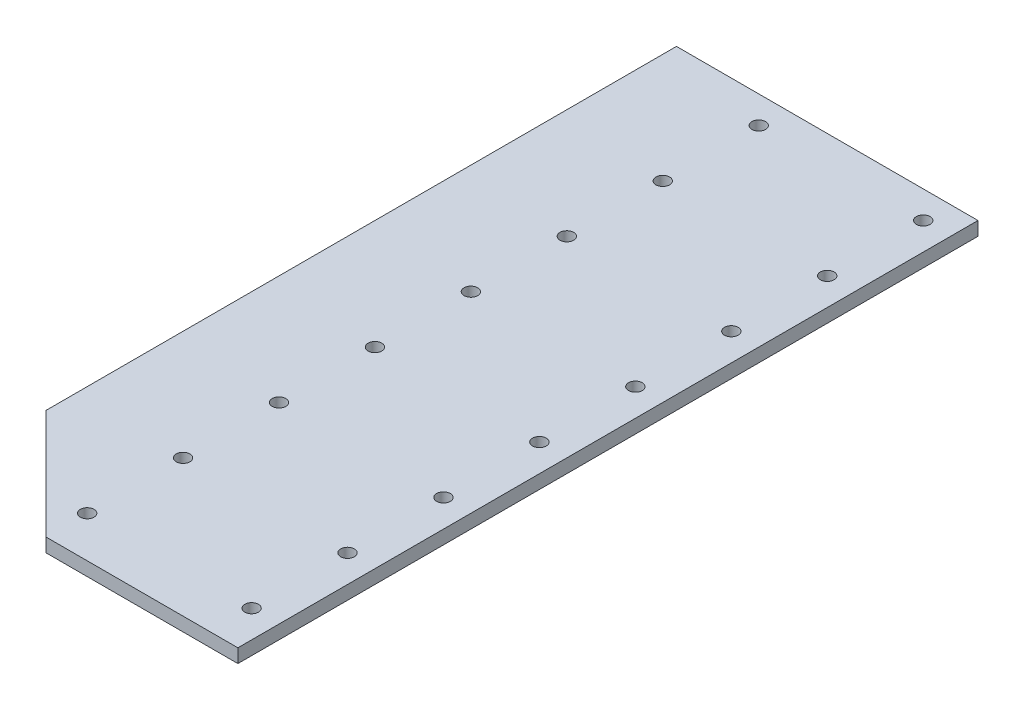
ISO-10303-21;
HEADER;
FILE_DESCRIPTION(('STEP AP214'),'2;1');
FILE_NAME('part.step','',(''),(''),'','','');
FILE_SCHEMA(('AUTOMOTIVE_DESIGN { 1 0 10303 214 1 1 1 1 }'));
ENDSEC;
DATA;
#1=APPLICATION_CONTEXT('core data for automotive mechanical design processes');
#2=APPLICATION_PROTOCOL_DEFINITION('international standard','automotive_design',2000,#1);
#3=PRODUCT_CONTEXT('',#1,'mechanical');
#4=PRODUCT('Part','Part','',(#3));
#5=PRODUCT_RELATED_PRODUCT_CATEGORY('part','',(#4));
#6=PRODUCT_DEFINITION_FORMATION('','',#4);
#7=PRODUCT_DEFINITION_CONTEXT('part definition',#1,'design');
#8=PRODUCT_DEFINITION('design','',#6,#7);
#9=PRODUCT_DEFINITION_SHAPE('','',#8);
#10=(LENGTH_UNIT() NAMED_UNIT(*) SI_UNIT(.MILLI.,.METRE.));
#11=(NAMED_UNIT(*) PLANE_ANGLE_UNIT() SI_UNIT($,.RADIAN.));
#12=(NAMED_UNIT(*) SI_UNIT($,.STERADIAN.) SOLID_ANGLE_UNIT());
#13=UNCERTAINTY_MEASURE_WITH_UNIT(LENGTH_MEASURE(1.E-05),#10,'distance_accuracy_value','');
#14=(GEOMETRIC_REPRESENTATION_CONTEXT(3) GLOBAL_UNCERTAINTY_ASSIGNED_CONTEXT((#13)) GLOBAL_UNIT_ASSIGNED_CONTEXT((#10,
#11,#12)) REPRESENTATION_CONTEXT('',''));
#15=CARTESIAN_POINT('',(0.,0.,0.));
#16=DIRECTION('',(0.,0.,1.));
#17=DIRECTION('',(1.,0.,0.));
#18=AXIS2_PLACEMENT_3D('',#15,#16,#17);
#19=CARTESIAN_POINT('',(0.,5.,0.));
#20=DIRECTION('',(0.,1.,0.));
#21=DIRECTION('',(0.,0.,1.));
#22=AXIS2_PLACEMENT_3D('',#19,#20,#21);
#23=PLANE('',#22);
#24=CARTESIAN_POINT('',(40.,5.,24.9999999999998));
#25=DIRECTION('',(0.,1.,0.));
#26=DIRECTION('',(0.,0.,1.));
#27=AXIS2_PLACEMENT_3D('',#24,#25,#26);
#28=CIRCLE('',#27,2.5);
#29=CARTESIAN_POINT('',(40.,5.,27.4999999999998));
#30=VERTEX_POINT('',#29);
#31=EDGE_CURVE('E248',#30,#30,#28,.T.);
#32=ORIENTED_EDGE('',*,*,#31,.F.);
#33=EDGE_LOOP('',(#32));
#34=FACE_BOUND('',#33,.T.);
#35=CARTESIAN_POINT('',(40.,5.,-10.0000000000001));
#36=DIRECTION('',(0.,1.,0.));
#37=DIRECTION('',(0.,0.,1.));
#38=AXIS2_PLACEMENT_3D('',#35,#36,#37);
#39=CIRCLE('',#38,2.5);
#40=CARTESIAN_POINT('',(40.,5.,-7.50000000000015));
#41=VERTEX_POINT('',#40);
#42=EDGE_CURVE('E264',#41,#41,#39,.T.);
#43=ORIENTED_EDGE('',*,*,#42,.F.);
#44=EDGE_LOOP('',(#43));
#45=FACE_BOUND('',#44,.T.);
#46=CARTESIAN_POINT('',(40.,5.,-45.0000000000001));
#47=DIRECTION('',(0.,1.,0.));
#48=DIRECTION('',(0.,0.,1.));
#49=AXIS2_PLACEMENT_3D('',#46,#47,#48);
#50=CIRCLE('',#49,2.5);
#51=CARTESIAN_POINT('',(40.,5.,-42.5000000000001));
#52=VERTEX_POINT('',#51);
#53=EDGE_CURVE('E280',#52,#52,#50,.T.);
#54=ORIENTED_EDGE('',*,*,#53,.F.);
#55=EDGE_LOOP('',(#54));
#56=FACE_BOUND('',#55,.T.);
#57=CARTESIAN_POINT('',(40.,5.,-80.0000000000001));
#58=DIRECTION('',(0.,1.,0.));
#59=DIRECTION('',(0.,0.,1.));
#60=AXIS2_PLACEMENT_3D('',#57,#58,#59);
#61=CIRCLE('',#60,2.5);
#62=CARTESIAN_POINT('',(40.,5.,-77.5000000000001));
#63=VERTEX_POINT('',#62);
#64=EDGE_CURVE('E296',#63,#63,#61,.T.);
#65=ORIENTED_EDGE('',*,*,#64,.F.);
#66=EDGE_LOOP('',(#65));
#67=FACE_BOUND('',#66,.T.);
#68=CARTESIAN_POINT('',(40.,5.,-115.));
#69=DIRECTION('',(0.,1.,0.));
#70=DIRECTION('',(0.,0.,1.));
#71=AXIS2_PLACEMENT_3D('',#68,#69,#70);
#72=CIRCLE('',#71,2.5);
#73=CARTESIAN_POINT('',(40.,5.,-112.5));
#74=VERTEX_POINT('',#73);
#75=EDGE_CURVE('E312',#74,#74,#72,.T.);
#76=ORIENTED_EDGE('',*,*,#75,.F.);
#77=EDGE_LOOP('',(#76));
#78=FACE_BOUND('',#77,.T.);
#79=CARTESIAN_POINT('',(40.,5.,-150.));
#80=DIRECTION('',(0.,1.,0.));
#81=DIRECTION('',(0.,0.,1.));
#82=AXIS2_PLACEMENT_3D('',#79,#80,#81);
#83=CIRCLE('',#82,2.5);
#84=CARTESIAN_POINT('',(40.,5.,-147.5));
#85=VERTEX_POINT('',#84);
#86=EDGE_CURVE('E328',#85,#85,#83,.T.);
#87=ORIENTED_EDGE('',*,*,#86,.F.);
#88=EDGE_LOOP('',(#87));
#89=FACE_BOUND('',#88,.T.);
#90=CARTESIAN_POINT('',(40.,5.,-185.));
#91=DIRECTION('',(0.,1.,0.));
#92=DIRECTION('',(0.,0.,1.));
#93=AXIS2_PLACEMENT_3D('',#90,#91,#92);
#94=CIRCLE('',#93,2.5);
#95=CARTESIAN_POINT('',(40.,5.,-182.5));
#96=VERTEX_POINT('',#95);
#97=EDGE_CURVE('E344',#96,#96,#94,.T.);
#98=ORIENTED_EDGE('',*,*,#97,.F.);
#99=EDGE_LOOP('',(#98));
#100=FACE_BOUND('',#99,.T.);
#101=CARTESIAN_POINT('',(40.,5.,-220.));
#102=DIRECTION('',(0.,1.,0.));
#103=DIRECTION('',(0.,0.,1.));
#104=AXIS2_PLACEMENT_3D('',#101,#102,#103);
#105=CIRCLE('',#104,2.5);
#106=CARTESIAN_POINT('',(40.,5.,-217.5));
#107=VERTEX_POINT('',#106);
#108=EDGE_CURVE('E129',#107,#107,#105,.T.);
#109=ORIENTED_EDGE('',*,*,#108,.F.);
#110=EDGE_LOOP('',(#109));
#111=FACE_BOUND('',#110,.T.);
#112=DIRECTION('',(0.707106781186556,0.,0.707106781186539));
#113=VECTOR('',#112,1.);
#114=CARTESIAN_POINT('',(0.,5.,0.));
#115=LINE('',#114,#113);
#116=CARTESIAN_POINT('',(0.,5.,0.));
#117=VERTEX_POINT('',#116);
#118=CARTESIAN_POINT('',(40.,5.,39.999999999999));
#119=VERTEX_POINT('',#118);
#120=EDGE_CURVE('E139',#117,#119,#115,.T.);
#121=ORIENTED_EDGE('',*,*,#120,.T.);
#122=DIRECTION('',(1.,0.,0.));
#123=VECTOR('',#122,1.);
#124=CARTESIAN_POINT('',(40.,5.,39.999999999999));
#125=LINE('',#124,#123);
#126=CARTESIAN_POINT('',(110.,5.,39.999999999999));
#127=VERTEX_POINT('',#126);
#128=EDGE_CURVE('E97',#119,#127,#125,.T.);
#129=ORIENTED_EDGE('',*,*,#128,.T.);
#130=DIRECTION('',(0.,0.,-1.));
#131=VECTOR('',#130,1.);
#132=CARTESIAN_POINT('',(110.,5.,39.999999999999));
#133=LINE('',#132,#131);
#134=CARTESIAN_POINT('',(110.,5.,-230.));
#135=VERTEX_POINT('',#134);
#136=EDGE_CURVE('E101',#127,#135,#133,.T.);
#137=ORIENTED_EDGE('',*,*,#136,.T.);
#138=DIRECTION('',(-1.,0.,0.));
#139=VECTOR('',#138,1.);
#140=CARTESIAN_POINT('',(0.,5.,-230.));
#141=LINE('',#140,#139);
#142=CARTESIAN_POINT('',(0.,5.,-230.));
#143=VERTEX_POINT('',#142);
#144=EDGE_CURVE('E105',#135,#143,#141,.T.);
#145=ORIENTED_EDGE('',*,*,#144,.T.);
#146=DIRECTION('',(0.,0.,1.));
#147=VECTOR('',#146,1.);
#148=CARTESIAN_POINT('',(0.,5.,0.));
#149=LINE('',#148,#147);
#150=EDGE_CURVE('E63',#143,#117,#149,.T.);
#151=ORIENTED_EDGE('',*,*,#150,.T.);
#152=EDGE_LOOP('',(#121,#129,#137,#145,#151));
#153=FACE_BOUND('',#152,.T.);
#154=CARTESIAN_POINT('',(100.,5.,-220.));
#155=DIRECTION('',(0.,1.,0.));
#156=DIRECTION('',(0.,0.,1.));
#157=AXIS2_PLACEMENT_3D('',#154,#155,#156);
#158=CIRCLE('',#157,2.5);
#159=CARTESIAN_POINT('',(100.,5.,-217.5));
#160=VERTEX_POINT('',#159);
#161=EDGE_CURVE('E352',#160,#160,#158,.T.);
#162=ORIENTED_EDGE('',*,*,#161,.F.);
#163=EDGE_LOOP('',(#162));
#164=FACE_BOUND('',#163,.T.);
#165=CARTESIAN_POINT('',(100.,5.,-185.));
#166=DIRECTION('',(0.,1.,0.));
#167=DIRECTION('',(0.,0.,1.));
#168=AXIS2_PLACEMENT_3D('',#165,#166,#167);
#169=CIRCLE('',#168,2.5);
#170=CARTESIAN_POINT('',(100.,5.,-182.5));
#171=VERTEX_POINT('',#170);
#172=EDGE_CURVE('E336',#171,#171,#169,.T.);
#173=ORIENTED_EDGE('',*,*,#172,.F.);
#174=EDGE_LOOP('',(#173));
#175=FACE_BOUND('',#174,.T.);
#176=CARTESIAN_POINT('',(100.,5.,-150.));
#177=DIRECTION('',(0.,1.,0.));
#178=DIRECTION('',(0.,0.,1.));
#179=AXIS2_PLACEMENT_3D('',#176,#177,#178);
#180=CIRCLE('',#179,2.5);
#181=CARTESIAN_POINT('',(100.,5.,-147.5));
#182=VERTEX_POINT('',#181);
#183=EDGE_CURVE('E320',#182,#182,#180,.T.);
#184=ORIENTED_EDGE('',*,*,#183,.F.);
#185=EDGE_LOOP('',(#184));
#186=FACE_BOUND('',#185,.T.);
#187=CARTESIAN_POINT('',(100.,5.,-115.));
#188=DIRECTION('',(0.,1.,0.));
#189=DIRECTION('',(0.,0.,1.));
#190=AXIS2_PLACEMENT_3D('',#187,#188,#189);
#191=CIRCLE('',#190,2.5);
#192=CARTESIAN_POINT('',(100.,5.,-112.5));
#193=VERTEX_POINT('',#192);
#194=EDGE_CURVE('E304',#193,#193,#191,.T.);
#195=ORIENTED_EDGE('',*,*,#194,.F.);
#196=EDGE_LOOP('',(#195));
#197=FACE_BOUND('',#196,.T.);
#198=CARTESIAN_POINT('',(100.,5.,-80.0000000000001));
#199=DIRECTION('',(0.,1.,0.));
#200=DIRECTION('',(0.,0.,1.));
#201=AXIS2_PLACEMENT_3D('',#198,#199,#200);
#202=CIRCLE('',#201,2.5);
#203=CARTESIAN_POINT('',(100.,5.,-77.5000000000001));
#204=VERTEX_POINT('',#203);
#205=EDGE_CURVE('E288',#204,#204,#202,.T.);
#206=ORIENTED_EDGE('',*,*,#205,.F.);
#207=EDGE_LOOP('',(#206));
#208=FACE_BOUND('',#207,.T.);
#209=CARTESIAN_POINT('',(100.,5.,-45.0000000000001));
#210=DIRECTION('',(0.,1.,0.));
#211=DIRECTION('',(0.,0.,1.));
#212=AXIS2_PLACEMENT_3D('',#209,#210,#211);
#213=CIRCLE('',#212,2.5);
#214=CARTESIAN_POINT('',(100.,5.,-42.5000000000001));
#215=VERTEX_POINT('',#214);
#216=EDGE_CURVE('E272',#215,#215,#213,.T.);
#217=ORIENTED_EDGE('',*,*,#216,.F.);
#218=EDGE_LOOP('',(#217));
#219=FACE_BOUND('',#218,.T.);
#220=CARTESIAN_POINT('',(100.,5.,-10.0000000000001));
#221=DIRECTION('',(0.,1.,0.));
#222=DIRECTION('',(0.,0.,1.));
#223=AXIS2_PLACEMENT_3D('',#220,#221,#222);
#224=CIRCLE('',#223,2.5);
#225=CARTESIAN_POINT('',(100.,5.,-7.50000000000015));
#226=VERTEX_POINT('',#225);
#227=EDGE_CURVE('E256',#226,#226,#224,.T.);
#228=ORIENTED_EDGE('',*,*,#227,.F.);
#229=EDGE_LOOP('',(#228));
#230=FACE_BOUND('',#229,.T.);
#231=CARTESIAN_POINT('',(100.,5.,24.9999999999998));
#232=DIRECTION('',(0.,1.,0.));
#233=DIRECTION('',(0.,0.,1.));
#234=AXIS2_PLACEMENT_3D('',#231,#232,#233);
#235=CIRCLE('',#234,2.49999999999999);
#236=CARTESIAN_POINT('',(100.,5.,27.4999999999998));
#237=VERTEX_POINT('',#236);
#238=EDGE_CURVE('E237',#237,#237,#235,.T.);
#239=ORIENTED_EDGE('',*,*,#238,.F.);
#240=EDGE_LOOP('',(#239));
#241=FACE_BOUND('',#240,.T.);
#242=ADVANCED_FACE('F45',(#34,#45,#56,#67,#78,#89,#100,#111,#153,#164,#175,#186,#197,#208,#219,
#230,#241),#23,.T.);
#243=CARTESIAN_POINT('',(0.,0.,0.));
#244=DIRECTION('',(0.,1.,0.));
#245=DIRECTION('',(0.,0.,1.));
#246=AXIS2_PLACEMENT_3D('',#243,#244,#245);
#247=PLANE('',#246);
#248=DIRECTION('',(0.707106781186556,0.,0.707106781186539));
#249=VECTOR('',#248,1.);
#250=CARTESIAN_POINT('',(0.,0.,0.));
#251=LINE('',#250,#249);
#252=CARTESIAN_POINT('',(0.,0.,0.));
#253=VERTEX_POINT('',#252);
#254=CARTESIAN_POINT('',(40.,0.,39.999999999999));
#255=VERTEX_POINT('',#254);
#256=EDGE_CURVE('E124',#253,#255,#251,.T.);
#257=ORIENTED_EDGE('',*,*,#256,.F.);
#258=DIRECTION('',(0.,0.,1.));
#259=VECTOR('',#258,1.);
#260=CARTESIAN_POINT('',(0.,0.,0.));
#261=LINE('',#260,#259);
#262=CARTESIAN_POINT('',(0.,0.,-230.));
#263=VERTEX_POINT('',#262);
#264=EDGE_CURVE('E89',#263,#253,#261,.T.);
#265=ORIENTED_EDGE('',*,*,#264,.F.);
#266=DIRECTION('',(-1.,0.,0.));
#267=VECTOR('',#266,1.);
#268=CARTESIAN_POINT('',(0.,0.,-230.));
#269=LINE('',#268,#267);
#270=CARTESIAN_POINT('',(110.,0.,-230.));
#271=VERTEX_POINT('',#270);
#272=EDGE_CURVE('E83',#271,#263,#269,.T.);
#273=ORIENTED_EDGE('',*,*,#272,.F.);
#274=DIRECTION('',(0.,0.,-1.));
#275=VECTOR('',#274,1.);
#276=CARTESIAN_POINT('',(110.,0.,35.));
#277=LINE('',#276,#275);
#278=CARTESIAN_POINT('',(110.,0.,39.999999999999));
#279=VERTEX_POINT('',#278);
#280=EDGE_CURVE('E112',#279,#271,#277,.T.);
#281=ORIENTED_EDGE('',*,*,#280,.F.);
#282=DIRECTION('',(1.,0.,0.));
#283=VECTOR('',#282,1.);
#284=CARTESIAN_POINT('',(40.,0.,39.999999999999));
#285=LINE('',#284,#283);
#286=EDGE_CURVE('E128',#255,#279,#285,.T.);
#287=ORIENTED_EDGE('',*,*,#286,.F.);
#288=EDGE_LOOP('',(#257,#265,#273,#281,#287));
#289=FACE_BOUND('',#288,.T.);
#290=CARTESIAN_POINT('',(40.,0.,-220.));
#291=DIRECTION('',(0.,1.,0.));
#292=DIRECTION('',(0.,0.,1.));
#293=AXIS2_PLACEMENT_3D('',#290,#291,#292);
#294=CIRCLE('',#293,2.5);
#295=CARTESIAN_POINT('',(40.,0.,-217.5));
#296=VERTEX_POINT('',#295);
#297=EDGE_CURVE('E356',#296,#296,#294,.T.);
#298=ORIENTED_EDGE('',*,*,#297,.T.);
#299=EDGE_LOOP('',(#298));
#300=FACE_BOUND('',#299,.T.);
#301=CARTESIAN_POINT('',(100.,0.,-220.));
#302=DIRECTION('',(0.,1.,0.));
#303=DIRECTION('',(0.,0.,1.));
#304=AXIS2_PLACEMENT_3D('',#301,#302,#303);
#305=CIRCLE('',#304,2.5);
#306=CARTESIAN_POINT('',(100.,0.,-217.5));
#307=VERTEX_POINT('',#306);
#308=EDGE_CURVE('E348',#307,#307,#305,.T.);
#309=ORIENTED_EDGE('',*,*,#308,.T.);
#310=EDGE_LOOP('',(#309));
#311=FACE_BOUND('',#310,.T.);
#312=CARTESIAN_POINT('',(40.,0.,-185.));
#313=DIRECTION('',(0.,1.,0.));
#314=DIRECTION('',(0.,0.,1.));
#315=AXIS2_PLACEMENT_3D('',#312,#313,#314);
#316=CIRCLE('',#315,2.5);
#317=CARTESIAN_POINT('',(40.,0.,-182.5));
#318=VERTEX_POINT('',#317);
#319=EDGE_CURVE('E340',#318,#318,#316,.T.);
#320=ORIENTED_EDGE('',*,*,#319,.T.);
#321=EDGE_LOOP('',(#320));
#322=FACE_BOUND('',#321,.T.);
#323=CARTESIAN_POINT('',(100.,0.,-185.));
#324=DIRECTION('',(0.,1.,0.));
#325=DIRECTION('',(0.,0.,1.));
#326=AXIS2_PLACEMENT_3D('',#323,#324,#325);
#327=CIRCLE('',#326,2.5);
#328=CARTESIAN_POINT('',(100.,0.,-182.5));
#329=VERTEX_POINT('',#328);
#330=EDGE_CURVE('E332',#329,#329,#327,.T.);
#331=ORIENTED_EDGE('',*,*,#330,.T.);
#332=EDGE_LOOP('',(#331));
#333=FACE_BOUND('',#332,.T.);
#334=CARTESIAN_POINT('',(40.,0.,-150.));
#335=DIRECTION('',(0.,1.,0.));
#336=DIRECTION('',(0.,0.,1.));
#337=AXIS2_PLACEMENT_3D('',#334,#335,#336);
#338=CIRCLE('',#337,2.5);
#339=CARTESIAN_POINT('',(40.,0.,-147.5));
#340=VERTEX_POINT('',#339);
#341=EDGE_CURVE('E324',#340,#340,#338,.T.);
#342=ORIENTED_EDGE('',*,*,#341,.T.);
#343=EDGE_LOOP('',(#342));
#344=FACE_BOUND('',#343,.T.);
#345=CARTESIAN_POINT('',(100.,0.,-150.));
#346=DIRECTION('',(0.,1.,0.));
#347=DIRECTION('',(0.,0.,1.));
#348=AXIS2_PLACEMENT_3D('',#345,#346,#347);
#349=CIRCLE('',#348,2.5);
#350=CARTESIAN_POINT('',(100.,0.,-147.5));
#351=VERTEX_POINT('',#350);
#352=EDGE_CURVE('E316',#351,#351,#349,.T.);
#353=ORIENTED_EDGE('',*,*,#352,.T.);
#354=EDGE_LOOP('',(#353));
#355=FACE_BOUND('',#354,.T.);
#356=CARTESIAN_POINT('',(40.,0.,-115.));
#357=DIRECTION('',(0.,1.,0.));
#358=DIRECTION('',(0.,0.,1.));
#359=AXIS2_PLACEMENT_3D('',#356,#357,#358);
#360=CIRCLE('',#359,2.5);
#361=CARTESIAN_POINT('',(40.,0.,-112.5));
#362=VERTEX_POINT('',#361);
#363=EDGE_CURVE('E308',#362,#362,#360,.T.);
#364=ORIENTED_EDGE('',*,*,#363,.T.);
#365=EDGE_LOOP('',(#364));
#366=FACE_BOUND('',#365,.T.);
#367=CARTESIAN_POINT('',(100.,0.,-115.));
#368=DIRECTION('',(0.,1.,0.));
#369=DIRECTION('',(0.,0.,1.));
#370=AXIS2_PLACEMENT_3D('',#367,#368,#369);
#371=CIRCLE('',#370,2.5);
#372=CARTESIAN_POINT('',(100.,0.,-112.5));
#373=VERTEX_POINT('',#372);
#374=EDGE_CURVE('E300',#373,#373,#371,.T.);
#375=ORIENTED_EDGE('',*,*,#374,.T.);
#376=EDGE_LOOP('',(#375));
#377=FACE_BOUND('',#376,.T.);
#378=CARTESIAN_POINT('',(40.,0.,-80.0000000000001));
#379=DIRECTION('',(0.,1.,0.));
#380=DIRECTION('',(0.,0.,1.));
#381=AXIS2_PLACEMENT_3D('',#378,#379,#380);
#382=CIRCLE('',#381,2.5);
#383=CARTESIAN_POINT('',(40.,0.,-77.5000000000001));
#384=VERTEX_POINT('',#383);
#385=EDGE_CURVE('E292',#384,#384,#382,.T.);
#386=ORIENTED_EDGE('',*,*,#385,.T.);
#387=EDGE_LOOP('',(#386));
#388=FACE_BOUND('',#387,.T.);
#389=CARTESIAN_POINT('',(100.,0.,-80.0000000000001));
#390=DIRECTION('',(0.,1.,0.));
#391=DIRECTION('',(0.,0.,1.));
#392=AXIS2_PLACEMENT_3D('',#389,#390,#391);
#393=CIRCLE('',#392,2.5);
#394=CARTESIAN_POINT('',(100.,0.,-77.5000000000001));
#395=VERTEX_POINT('',#394);
#396=EDGE_CURVE('E284',#395,#395,#393,.T.);
#397=ORIENTED_EDGE('',*,*,#396,.T.);
#398=EDGE_LOOP('',(#397));
#399=FACE_BOUND('',#398,.T.);
#400=CARTESIAN_POINT('',(40.,0.,-45.0000000000001));
#401=DIRECTION('',(0.,1.,0.));
#402=DIRECTION('',(0.,0.,1.));
#403=AXIS2_PLACEMENT_3D('',#400,#401,#402);
#404=CIRCLE('',#403,2.5);
#405=CARTESIAN_POINT('',(40.,0.,-42.5000000000001));
#406=VERTEX_POINT('',#405);
#407=EDGE_CURVE('E276',#406,#406,#404,.T.);
#408=ORIENTED_EDGE('',*,*,#407,.T.);
#409=EDGE_LOOP('',(#408));
#410=FACE_BOUND('',#409,.T.);
#411=CARTESIAN_POINT('',(100.,0.,-45.0000000000001));
#412=DIRECTION('',(0.,1.,0.));
#413=DIRECTION('',(0.,0.,1.));
#414=AXIS2_PLACEMENT_3D('',#411,#412,#413);
#415=CIRCLE('',#414,2.5);
#416=CARTESIAN_POINT('',(100.,0.,-42.5000000000001));
#417=VERTEX_POINT('',#416);
#418=EDGE_CURVE('E268',#417,#417,#415,.T.);
#419=ORIENTED_EDGE('',*,*,#418,.T.);
#420=EDGE_LOOP('',(#419));
#421=FACE_BOUND('',#420,.T.);
#422=CARTESIAN_POINT('',(40.,0.,-10.0000000000001));
#423=DIRECTION('',(0.,1.,0.));
#424=DIRECTION('',(0.,0.,1.));
#425=AXIS2_PLACEMENT_3D('',#422,#423,#424);
#426=CIRCLE('',#425,2.5);
#427=CARTESIAN_POINT('',(40.,0.,-7.50000000000015));
#428=VERTEX_POINT('',#427);
#429=EDGE_CURVE('E260',#428,#428,#426,.T.);
#430=ORIENTED_EDGE('',*,*,#429,.T.);
#431=EDGE_LOOP('',(#430));
#432=FACE_BOUND('',#431,.T.);
#433=CARTESIAN_POINT('',(100.,0.,-10.0000000000001));
#434=DIRECTION('',(0.,1.,0.));
#435=DIRECTION('',(0.,0.,1.));
#436=AXIS2_PLACEMENT_3D('',#433,#434,#435);
#437=CIRCLE('',#436,2.5);
#438=CARTESIAN_POINT('',(100.,0.,-7.50000000000015));
#439=VERTEX_POINT('',#438);
#440=EDGE_CURVE('E252',#439,#439,#437,.T.);
#441=ORIENTED_EDGE('',*,*,#440,.T.);
#442=EDGE_LOOP('',(#441));
#443=FACE_BOUND('',#442,.T.);
#444=CARTESIAN_POINT('',(40.,0.,24.9999999999998));
#445=DIRECTION('',(0.,1.,0.));
#446=DIRECTION('',(0.,0.,1.));
#447=AXIS2_PLACEMENT_3D('',#444,#445,#446);
#448=CIRCLE('',#447,2.5);
#449=CARTESIAN_POINT('',(40.,0.,27.4999999999998));
#450=VERTEX_POINT('',#449);
#451=EDGE_CURVE('E245',#450,#450,#448,.T.);
#452=ORIENTED_EDGE('',*,*,#451,.T.);
#453=EDGE_LOOP('',(#452));
#454=FACE_BOUND('',#453,.T.);
#455=CARTESIAN_POINT('',(100.,0.,24.9999999999998));
#456=DIRECTION('',(0.,1.,0.));
#457=DIRECTION('',(0.,0.,1.));
#458=AXIS2_PLACEMENT_3D('',#455,#456,#457);
#459=CIRCLE('',#458,2.49999999999999);
#460=CARTESIAN_POINT('',(100.,0.,27.4999999999998));
#461=VERTEX_POINT('',#460);
#462=EDGE_CURVE('E240',#461,#461,#459,.T.);
#463=ORIENTED_EDGE('',*,*,#462,.T.);
#464=EDGE_LOOP('',(#463));
#465=FACE_BOUND('',#464,.T.);
#466=ADVANCED_FACE('F148',(#289,#300,#311,#322,#333,#344,#355,#366,#377,#388,#399,#410,#421,
#432,#443,#454,#465),#247,.F.);
#467=CARTESIAN_POINT('',(0.,5.,0.));
#468=DIRECTION('',(0.707106781186539,0.,-0.707106781186556));
#469=DIRECTION('',(-0.707106781186556,0.,-0.707106781186539));
#470=AXIS2_PLACEMENT_3D('',#467,#468,#469);
#471=PLANE('',#470);
#472=ORIENTED_EDGE('',*,*,#256,.T.);
#473=DIRECTION('',(0.,-1.,0.));
#474=VECTOR('',#473,1.);
#475=CARTESIAN_POINT('',(40.,5.,39.999999999999));
#476=LINE('',#475,#474);
#477=EDGE_CURVE('E11',#119,#255,#476,.T.);
#478=ORIENTED_EDGE('',*,*,#477,.F.);
#479=ORIENTED_EDGE('',*,*,#120,.F.);
#480=DIRECTION('',(0.,-1.,0.));
#481=VECTOR('',#480,1.);
#482=CARTESIAN_POINT('',(0.,5.,0.));
#483=LINE('',#482,#481);
#484=EDGE_CURVE('E120',#117,#253,#483,.T.);
#485=ORIENTED_EDGE('',*,*,#484,.T.);
#486=EDGE_LOOP('',(#472,#478,#479,#485));
#487=FACE_BOUND('',#486,.T.);
#488=ADVANCED_FACE('F47',(#487),#471,.F.);
#489=CARTESIAN_POINT('',(40.,5.,39.999999999999));
#490=DIRECTION('',(0.,0.,-1.));
#491=DIRECTION('',(-1.,0.,0.));
#492=AXIS2_PLACEMENT_3D('',#489,#490,#491);
#493=PLANE('',#492);
#494=ORIENTED_EDGE('',*,*,#286,.T.);
#495=DIRECTION('',(0.,-1.,0.));
#496=VECTOR('',#495,1.);
#497=CARTESIAN_POINT('',(110.,5.,39.999999999999));
#498=LINE('',#497,#496);
#499=EDGE_CURVE('E55',#127,#279,#498,.T.);
#500=ORIENTED_EDGE('',*,*,#499,.F.);
#501=ORIENTED_EDGE('',*,*,#128,.F.);
#502=ORIENTED_EDGE('',*,*,#477,.T.);
#503=EDGE_LOOP('',(#494,#500,#501,#502));
#504=FACE_BOUND('',#503,.T.);
#505=ADVANCED_FACE('F144',(#504),#493,.F.);
#506=CARTESIAN_POINT('',(110.,5.,35.));
#507=DIRECTION('',(-1.,0.,0.));
#508=DIRECTION('',(0.,0.,1.));
#509=AXIS2_PLACEMENT_3D('',#506,#507,#508);
#510=PLANE('',#509);
#511=ORIENTED_EDGE('',*,*,#280,.T.);
#512=DIRECTION('',(0.,-1.,0.));
#513=VECTOR('',#512,1.);
#514=CARTESIAN_POINT('',(110.,5.,-230.));
#515=LINE('',#514,#513);
#516=EDGE_CURVE('E110',#135,#271,#515,.T.);
#517=ORIENTED_EDGE('',*,*,#516,.F.);
#518=ORIENTED_EDGE('',*,*,#136,.F.);
#519=ORIENTED_EDGE('',*,*,#499,.T.);
#520=EDGE_LOOP('',(#511,#517,#518,#519));
#521=FACE_BOUND('',#520,.T.);
#522=ADVANCED_FACE('F111',(#521),#510,.F.);
#523=CARTESIAN_POINT('',(0.,5.,-230.));
#524=DIRECTION('',(0.,0.,1.));
#525=DIRECTION('',(1.,0.,0.));
#526=AXIS2_PLACEMENT_3D('',#523,#524,#525);
#527=PLANE('',#526);
#528=ORIENTED_EDGE('',*,*,#272,.T.);
#529=DIRECTION('',(0.,-1.,0.));
#530=VECTOR('',#529,1.);
#531=CARTESIAN_POINT('',(0.,5.,-230.));
#532=LINE('',#531,#530);
#533=EDGE_CURVE('E114',#143,#263,#532,.T.);
#534=ORIENTED_EDGE('',*,*,#533,.F.);
#535=ORIENTED_EDGE('',*,*,#144,.F.);
#536=ORIENTED_EDGE('',*,*,#516,.T.);
#537=EDGE_LOOP('',(#528,#534,#535,#536));
#538=FACE_BOUND('',#537,.T.);
#539=ADVANCED_FACE('F116',(#538),#527,.F.);
#540=CARTESIAN_POINT('',(0.,5.,0.));
#541=DIRECTION('',(1.,0.,0.));
#542=DIRECTION('',(0.,0.,-1.));
#543=AXIS2_PLACEMENT_3D('',#540,#541,#542);
#544=PLANE('',#543);
#545=ORIENTED_EDGE('',*,*,#264,.T.);
#546=ORIENTED_EDGE('',*,*,#484,.F.);
#547=ORIENTED_EDGE('',*,*,#150,.F.);
#548=ORIENTED_EDGE('',*,*,#533,.T.);
#549=EDGE_LOOP('',(#545,#546,#547,#548));
#550=FACE_BOUND('',#549,.T.);
#551=ADVANCED_FACE('F152',(#550),#544,.F.);
#552=CARTESIAN_POINT('',(40.,5.,-220.));
#553=DIRECTION('',(0.,-1.,0.));
#554=DIRECTION('',(0.,0.,-1.));
#555=AXIS2_PLACEMENT_3D('',#552,#553,#554);
#556=CYLINDRICAL_SURFACE('',#555,2.5);
#557=ORIENTED_EDGE('',*,*,#108,.T.);
#558=EDGE_LOOP('',(#557));
#559=FACE_BOUND('',#558,.T.);
#560=ORIENTED_EDGE('',*,*,#297,.F.);
#561=EDGE_LOOP('',(#560));
#562=FACE_BOUND('',#561,.T.);
#563=ADVANCED_FACE('F154',(#559,#562),#556,.F.);
#564=CARTESIAN_POINT('',(100.,5.,-220.));
#565=DIRECTION('',(0.,-1.,0.));
#566=DIRECTION('',(0.,0.,-1.));
#567=AXIS2_PLACEMENT_3D('',#564,#565,#566);
#568=CYLINDRICAL_SURFACE('',#567,2.5);
#569=ORIENTED_EDGE('',*,*,#161,.T.);
#570=EDGE_LOOP('',(#569));
#571=FACE_BOUND('',#570,.T.);
#572=ORIENTED_EDGE('',*,*,#308,.F.);
#573=EDGE_LOOP('',(#572));
#574=FACE_BOUND('',#573,.T.);
#575=ADVANCED_FACE('F160',(#571,#574),#568,.F.);
#576=CARTESIAN_POINT('',(40.,5.,-185.));
#577=DIRECTION('',(0.,-1.,0.));
#578=DIRECTION('',(0.,0.,-1.));
#579=AXIS2_PLACEMENT_3D('',#576,#577,#578);
#580=CYLINDRICAL_SURFACE('',#579,2.5);
#581=ORIENTED_EDGE('',*,*,#97,.T.);
#582=EDGE_LOOP('',(#581));
#583=FACE_BOUND('',#582,.T.);
#584=ORIENTED_EDGE('',*,*,#319,.F.);
#585=EDGE_LOOP('',(#584));
#586=FACE_BOUND('',#585,.T.);
#587=ADVANCED_FACE('F176',(#583,#586),#580,.F.);
#588=CARTESIAN_POINT('',(100.,5.,-185.));
#589=DIRECTION('',(0.,-1.,0.));
#590=DIRECTION('',(0.,0.,-1.));
#591=AXIS2_PLACEMENT_3D('',#588,#589,#590);
#592=CYLINDRICAL_SURFACE('',#591,2.5);
#593=ORIENTED_EDGE('',*,*,#172,.T.);
#594=EDGE_LOOP('',(#593));
#595=FACE_BOUND('',#594,.T.);
#596=ORIENTED_EDGE('',*,*,#330,.F.);
#597=EDGE_LOOP('',(#596));
#598=FACE_BOUND('',#597,.T.);
#599=ADVANCED_FACE('F180',(#595,#598),#592,.F.);
#600=CARTESIAN_POINT('',(40.,5.,-150.));
#601=DIRECTION('',(0.,-1.,0.));
#602=DIRECTION('',(0.,0.,-1.));
#603=AXIS2_PLACEMENT_3D('',#600,#601,#602);
#604=CYLINDRICAL_SURFACE('',#603,2.5);
#605=ORIENTED_EDGE('',*,*,#86,.T.);
#606=EDGE_LOOP('',(#605));
#607=FACE_BOUND('',#606,.T.);
#608=ORIENTED_EDGE('',*,*,#341,.F.);
#609=EDGE_LOOP('',(#608));
#610=FACE_BOUND('',#609,.T.);
#611=ADVANCED_FACE('F184',(#607,#610),#604,.F.);
#612=CARTESIAN_POINT('',(100.,5.,-150.));
#613=DIRECTION('',(0.,-1.,0.));
#614=DIRECTION('',(0.,0.,-1.));
#615=AXIS2_PLACEMENT_3D('',#612,#613,#614);
#616=CYLINDRICAL_SURFACE('',#615,2.5);
#617=ORIENTED_EDGE('',*,*,#183,.T.);
#618=EDGE_LOOP('',(#617));
#619=FACE_BOUND('',#618,.T.);
#620=ORIENTED_EDGE('',*,*,#352,.F.);
#621=EDGE_LOOP('',(#620));
#622=FACE_BOUND('',#621,.T.);
#623=ADVANCED_FACE('F188',(#619,#622),#616,.F.);
#624=CARTESIAN_POINT('',(40.,5.,-115.));
#625=DIRECTION('',(0.,-1.,0.));
#626=DIRECTION('',(0.,0.,-1.));
#627=AXIS2_PLACEMENT_3D('',#624,#625,#626);
#628=CYLINDRICAL_SURFACE('',#627,2.5);
#629=ORIENTED_EDGE('',*,*,#75,.T.);
#630=EDGE_LOOP('',(#629));
#631=FACE_BOUND('',#630,.T.);
#632=ORIENTED_EDGE('',*,*,#363,.F.);
#633=EDGE_LOOP('',(#632));
#634=FACE_BOUND('',#633,.T.);
#635=ADVANCED_FACE('F192',(#631,#634),#628,.F.);
#636=CARTESIAN_POINT('',(100.,5.,-115.));
#637=DIRECTION('',(0.,-1.,0.));
#638=DIRECTION('',(0.,0.,-1.));
#639=AXIS2_PLACEMENT_3D('',#636,#637,#638);
#640=CYLINDRICAL_SURFACE('',#639,2.5);
#641=ORIENTED_EDGE('',*,*,#194,.T.);
#642=EDGE_LOOP('',(#641));
#643=FACE_BOUND('',#642,.T.);
#644=ORIENTED_EDGE('',*,*,#374,.F.);
#645=EDGE_LOOP('',(#644));
#646=FACE_BOUND('',#645,.T.);
#647=ADVANCED_FACE('F196',(#643,#646),#640,.F.);
#648=CARTESIAN_POINT('',(40.,5.,-80.0000000000001));
#649=DIRECTION('',(0.,-1.,0.));
#650=DIRECTION('',(0.,0.,-1.));
#651=AXIS2_PLACEMENT_3D('',#648,#649,#650);
#652=CYLINDRICAL_SURFACE('',#651,2.5);
#653=ORIENTED_EDGE('',*,*,#64,.T.);
#654=EDGE_LOOP('',(#653));
#655=FACE_BOUND('',#654,.T.);
#656=ORIENTED_EDGE('',*,*,#385,.F.);
#657=EDGE_LOOP('',(#656));
#658=FACE_BOUND('',#657,.T.);
#659=ADVANCED_FACE('F200',(#655,#658),#652,.F.);
#660=CARTESIAN_POINT('',(100.,5.,-80.0000000000001));
#661=DIRECTION('',(0.,-1.,0.));
#662=DIRECTION('',(0.,0.,-1.));
#663=AXIS2_PLACEMENT_3D('',#660,#661,#662);
#664=CYLINDRICAL_SURFACE('',#663,2.5);
#665=ORIENTED_EDGE('',*,*,#205,.T.);
#666=EDGE_LOOP('',(#665));
#667=FACE_BOUND('',#666,.T.);
#668=ORIENTED_EDGE('',*,*,#396,.F.);
#669=EDGE_LOOP('',(#668));
#670=FACE_BOUND('',#669,.T.);
#671=ADVANCED_FACE('F204',(#667,#670),#664,.F.);
#672=CARTESIAN_POINT('',(40.,5.,-45.0000000000001));
#673=DIRECTION('',(0.,-1.,0.));
#674=DIRECTION('',(0.,0.,-1.));
#675=AXIS2_PLACEMENT_3D('',#672,#673,#674);
#676=CYLINDRICAL_SURFACE('',#675,2.5);
#677=ORIENTED_EDGE('',*,*,#53,.T.);
#678=EDGE_LOOP('',(#677));
#679=FACE_BOUND('',#678,.T.);
#680=ORIENTED_EDGE('',*,*,#407,.F.);
#681=EDGE_LOOP('',(#680));
#682=FACE_BOUND('',#681,.T.);
#683=ADVANCED_FACE('F208',(#679,#682),#676,.F.);
#684=CARTESIAN_POINT('',(100.,5.,-45.0000000000001));
#685=DIRECTION('',(0.,-1.,0.));
#686=DIRECTION('',(0.,0.,-1.));
#687=AXIS2_PLACEMENT_3D('',#684,#685,#686);
#688=CYLINDRICAL_SURFACE('',#687,2.5);
#689=ORIENTED_EDGE('',*,*,#216,.T.);
#690=EDGE_LOOP('',(#689));
#691=FACE_BOUND('',#690,.T.);
#692=ORIENTED_EDGE('',*,*,#418,.F.);
#693=EDGE_LOOP('',(#692));
#694=FACE_BOUND('',#693,.T.);
#695=ADVANCED_FACE('F212',(#691,#694),#688,.F.);
#696=CARTESIAN_POINT('',(40.,5.,-10.0000000000001));
#697=DIRECTION('',(0.,-1.,0.));
#698=DIRECTION('',(0.,0.,-1.));
#699=AXIS2_PLACEMENT_3D('',#696,#697,#698);
#700=CYLINDRICAL_SURFACE('',#699,2.5);
#701=ORIENTED_EDGE('',*,*,#42,.T.);
#702=EDGE_LOOP('',(#701));
#703=FACE_BOUND('',#702,.T.);
#704=ORIENTED_EDGE('',*,*,#429,.F.);
#705=EDGE_LOOP('',(#704));
#706=FACE_BOUND('',#705,.T.);
#707=ADVANCED_FACE('F216',(#703,#706),#700,.F.);
#708=CARTESIAN_POINT('',(100.,5.,-10.0000000000001));
#709=DIRECTION('',(0.,-1.,0.));
#710=DIRECTION('',(0.,0.,-1.));
#711=AXIS2_PLACEMENT_3D('',#708,#709,#710);
#712=CYLINDRICAL_SURFACE('',#711,2.5);
#713=ORIENTED_EDGE('',*,*,#227,.T.);
#714=EDGE_LOOP('',(#713));
#715=FACE_BOUND('',#714,.T.);
#716=ORIENTED_EDGE('',*,*,#440,.F.);
#717=EDGE_LOOP('',(#716));
#718=FACE_BOUND('',#717,.T.);
#719=ADVANCED_FACE('F220',(#715,#718),#712,.F.);
#720=CARTESIAN_POINT('',(40.,5.,24.9999999999998));
#721=DIRECTION('',(0.,-1.,0.));
#722=DIRECTION('',(0.,0.,-1.));
#723=AXIS2_PLACEMENT_3D('',#720,#721,#722);
#724=CYLINDRICAL_SURFACE('',#723,2.5);
#725=ORIENTED_EDGE('',*,*,#31,.T.);
#726=EDGE_LOOP('',(#725));
#727=FACE_BOUND('',#726,.T.);
#728=ORIENTED_EDGE('',*,*,#451,.F.);
#729=EDGE_LOOP('',(#728));
#730=FACE_BOUND('',#729,.T.);
#731=ADVANCED_FACE('F224',(#727,#730),#724,.F.);
#732=CARTESIAN_POINT('',(100.,5.,24.9999999999998));
#733=DIRECTION('',(0.,-1.,0.));
#734=DIRECTION('',(0.,0.,-1.));
#735=AXIS2_PLACEMENT_3D('',#732,#733,#734);
#736=CYLINDRICAL_SURFACE('',#735,2.49999999999999);
#737=ORIENTED_EDGE('',*,*,#238,.T.);
#738=EDGE_LOOP('',(#737));
#739=FACE_BOUND('',#738,.T.);
#740=ORIENTED_EDGE('',*,*,#462,.F.);
#741=EDGE_LOOP('',(#740));
#742=FACE_BOUND('',#741,.T.);
#743=ADVANCED_FACE('F228',(#739,#742),#736,.F.);
#744=CLOSED_SHELL('',(#242,#466,#488,#505,#522,#539,#551,#563,#575,#587,#599,#611,#623,#635,
#647,#659,#671,#683,#695,#707,#719,#731,#743));
#745=MANIFOLD_SOLID_BREP('B2',#744);
#746=ADVANCED_BREP_SHAPE_REPRESENTATION('',(#18,#745),#14);
#747=SHAPE_DEFINITION_REPRESENTATION(#9,#746);
ENDSEC;
END-ISO-10303-21;
